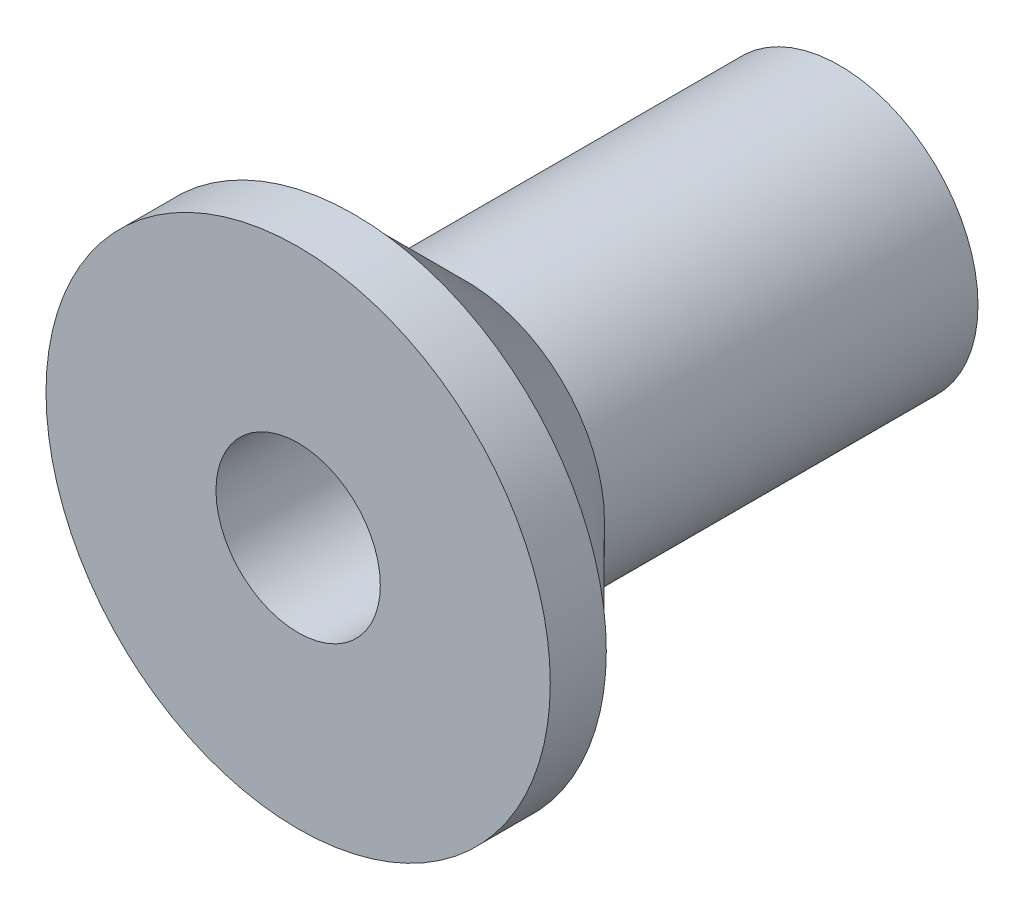
ISO-10303-21;
HEADER;
FILE_DESCRIPTION(('STEP AP214'),'2;1');
FILE_NAME('part.step','',(''),(''),'','','');
FILE_SCHEMA(('AUTOMOTIVE_DESIGN { 1 0 10303 214 1 1 1 1 }'));
ENDSEC;
DATA;
#1=APPLICATION_CONTEXT('core data for automotive mechanical design processes');
#2=APPLICATION_PROTOCOL_DEFINITION('international standard','automotive_design',2000,#1);
#3=PRODUCT_CONTEXT('',#1,'mechanical');
#4=PRODUCT('Part','Part','',(#3));
#5=PRODUCT_RELATED_PRODUCT_CATEGORY('part','',(#4));
#6=PRODUCT_DEFINITION_FORMATION('','',#4);
#7=PRODUCT_DEFINITION_CONTEXT('part definition',#1,'design');
#8=PRODUCT_DEFINITION('design','',#6,#7);
#9=PRODUCT_DEFINITION_SHAPE('','',#8);
#10=(LENGTH_UNIT() NAMED_UNIT(*) SI_UNIT(.MILLI.,.METRE.));
#11=(NAMED_UNIT(*) PLANE_ANGLE_UNIT() SI_UNIT($,.RADIAN.));
#12=(NAMED_UNIT(*) SI_UNIT($,.STERADIAN.) SOLID_ANGLE_UNIT());
#13=UNCERTAINTY_MEASURE_WITH_UNIT(LENGTH_MEASURE(1.E-05),#10,'distance_accuracy_value','');
#14=(GEOMETRIC_REPRESENTATION_CONTEXT(3) GLOBAL_UNCERTAINTY_ASSIGNED_CONTEXT((#13)) GLOBAL_UNIT_ASSIGNED_CONTEXT((#10,
#11,#12)) REPRESENTATION_CONTEXT('',''));
#15=CARTESIAN_POINT('',(0.,0.,0.));
#16=DIRECTION('',(0.,0.,1.));
#17=DIRECTION('',(1.,0.,0.));
#18=AXIS2_PLACEMENT_3D('',#15,#16,#17);
#19=CARTESIAN_POINT('',(0.,0.,-24.5));
#20=DIRECTION('',(0.,0.,-1.));
#21=DIRECTION('',(-1.,0.,0.));
#22=AXIS2_PLACEMENT_3D('',#19,#20,#21);
#23=PLANE('',#22);
#24=CARTESIAN_POINT('',(0.,0.,-24.5));
#25=DIRECTION('',(0.,0.,-1.));
#26=DIRECTION('',(-1.,0.,0.));
#27=AXIS2_PLACEMENT_3D('',#24,#25,#26);
#28=CIRCLE('',#27,6.70000000000001);
#29=CARTESIAN_POINT('',(-6.70000000000001,0.,-24.5));
#30=VERTEX_POINT('',#29);
#31=EDGE_CURVE('E10',#30,#30,#28,.F.);
#32=ORIENTED_EDGE('',*,*,#31,.T.);
#33=EDGE_LOOP('',(#32));
#34=FACE_BOUND('',#33,.T.);
#35=CARTESIAN_POINT('',(0.,0.,-24.5));
#36=DIRECTION('',(0.,0.,-1.));
#37=DIRECTION('',(-1.,0.,0.));
#38=AXIS2_PLACEMENT_3D('',#35,#36,#37);
#39=CIRCLE('',#38,6.75);
#40=CARTESIAN_POINT('',(-6.75,0.,-24.5));
#41=VERTEX_POINT('',#40);
#42=EDGE_CURVE('E44',#41,#41,#39,.T.);
#43=ORIENTED_EDGE('',*,*,#42,.T.);
#44=EDGE_LOOP('',(#43));
#45=FACE_BOUND('',#44,.T.);
#46=ADVANCED_FACE('F32',(#34,#45),#23,.T.);
#47=CARTESIAN_POINT('',(0.,0.,-23.));
#48=DIRECTION('',(0.,0.,-1.));
#49=DIRECTION('',(-1.,0.,0.));
#50=AXIS2_PLACEMENT_3D('',#47,#48,#49);
#51=PLANE('',#50);
#52=CARTESIAN_POINT('',(0.,0.,-23.));
#53=DIRECTION('',(0.,0.,-1.));
#54=DIRECTION('',(-1.,0.,0.));
#55=AXIS2_PLACEMENT_3D('',#52,#53,#54);
#56=CIRCLE('',#55,6.75);
#57=CARTESIAN_POINT('',(-6.75,0.,-23.));
#58=VERTEX_POINT('',#57);
#59=EDGE_CURVE('E48',#58,#58,#56,.T.);
#60=ORIENTED_EDGE('',*,*,#59,.F.);
#61=EDGE_LOOP('',(#60));
#62=FACE_BOUND('',#61,.T.);
#63=CARTESIAN_POINT('',(0.,0.,-23.));
#64=DIRECTION('',(0.,0.,-1.));
#65=DIRECTION('',(-1.,0.,0.));
#66=AXIS2_PLACEMENT_3D('',#63,#64,#65);
#67=CIRCLE('',#66,2.2);
#68=CARTESIAN_POINT('',(-2.2,0.,-23.));
#69=VERTEX_POINT('',#68);
#70=EDGE_CURVE('E52',#69,#69,#67,.T.);
#71=ORIENTED_EDGE('',*,*,#70,.T.);
#72=EDGE_LOOP('',(#71));
#73=FACE_BOUND('',#72,.T.);
#74=ADVANCED_FACE('F78',(#62,#73),#51,.F.);
#75=CARTESIAN_POINT('',(0.,0.,-24.5));
#76=DIRECTION('',(0.,0.,1.));
#77=DIRECTION('',(1.,0.,0.));
#78=AXIS2_PLACEMENT_3D('',#75,#76,#77);
#79=CYLINDRICAL_SURFACE('',#78,6.75);
#80=ORIENTED_EDGE('',*,*,#42,.F.);
#81=EDGE_LOOP('',(#80));
#82=FACE_BOUND('',#81,.T.);
#83=ORIENTED_EDGE('',*,*,#59,.T.);
#84=EDGE_LOOP('',(#83));
#85=FACE_BOUND('',#84,.T.);
#86=ADVANCED_FACE('F69',(#82,#85),#79,.T.);
#87=CARTESIAN_POINT('',(0.,0.,-24.5));
#88=DIRECTION('',(0.,0.,1.));
#89=DIRECTION('',(1.,0.,0.));
#90=AXIS2_PLACEMENT_3D('',#87,#88,#89);
#91=CYLINDRICAL_SURFACE('',#90,2.2);
#92=ORIENTED_EDGE('',*,*,#70,.F.);
#93=EDGE_LOOP('',(#92));
#94=FACE_BOUND('',#93,.T.);
#95=CARTESIAN_POINT('',(0.,0.,-37.5));
#96=DIRECTION('',(0.,0.,1.));
#97=DIRECTION('',(1.,0.,0.));
#98=AXIS2_PLACEMENT_3D('',#95,#96,#97);
#99=CIRCLE('',#98,2.2);
#100=CARTESIAN_POINT('',(2.2,0.,-37.5));
#101=VERTEX_POINT('',#100);
#102=EDGE_CURVE('E59',#101,#101,#99,.T.);
#103=ORIENTED_EDGE('',*,*,#102,.F.);
#104=EDGE_LOOP('',(#103));
#105=FACE_BOUND('',#104,.T.);
#106=ADVANCED_FACE('F66',(#94,#105),#91,.F.);
#107=CARTESIAN_POINT('',(0.,0.,-37.5));
#108=DIRECTION('',(0.,0.,1.));
#109=DIRECTION('',(1.,0.,0.));
#110=AXIS2_PLACEMENT_3D('',#107,#108,#109);
#111=CYLINDRICAL_SURFACE('',#110,3.7);
#112=CARTESIAN_POINT('',(0.,0.,-27.5));
#113=DIRECTION('',(0.,0.,-1.));
#114=DIRECTION('',(-1.,0.,0.));
#115=AXIS2_PLACEMENT_3D('',#112,#113,#114);
#116=CIRCLE('',#115,3.7);
#117=CARTESIAN_POINT('',(-3.7,0.,-27.5));
#118=VERTEX_POINT('',#117);
#119=EDGE_CURVE('E40',#118,#118,#116,.T.);
#120=ORIENTED_EDGE('',*,*,#119,.T.);
#121=EDGE_LOOP('',(#120));
#122=FACE_BOUND('',#121,.T.);
#123=CARTESIAN_POINT('',(0.,0.,-37.5));
#124=DIRECTION('',(0.,0.,1.));
#125=DIRECTION('',(1.,0.,0.));
#126=AXIS2_PLACEMENT_3D('',#123,#124,#125);
#127=CIRCLE('',#126,3.7);
#128=CARTESIAN_POINT('',(3.7,0.,-37.5));
#129=VERTEX_POINT('',#128);
#130=EDGE_CURVE('E56',#129,#129,#127,.T.);
#131=ORIENTED_EDGE('',*,*,#130,.T.);
#132=EDGE_LOOP('',(#131));
#133=FACE_BOUND('',#132,.T.);
#134=ADVANCED_FACE('F68',(#122,#133),#111,.T.);
#135=CARTESIAN_POINT('',(0.,0.,-37.5));
#136=DIRECTION('',(0.,0.,1.));
#137=DIRECTION('',(1.,0.,0.));
#138=AXIS2_PLACEMENT_3D('',#135,#136,#137);
#139=PLANE('',#138);
#140=ORIENTED_EDGE('',*,*,#102,.T.);
#141=EDGE_LOOP('',(#140));
#142=FACE_BOUND('',#141,.T.);
#143=ORIENTED_EDGE('',*,*,#130,.F.);
#144=EDGE_LOOP('',(#143));
#145=FACE_BOUND('',#144,.T.);
#146=ADVANCED_FACE('F63',(#142,#145),#139,.F.);
#147=CARTESIAN_POINT('',(0.,0.,-27.5));
#148=DIRECTION('',(0.,0.,1.));
#149=DIRECTION('',(1.,0.,0.));
#150=AXIS2_PLACEMENT_3D('',#147,#148,#149);
#151=CONICAL_SURFACE('',#150,3.7,0.785398163397443);
#152=ORIENTED_EDGE('',*,*,#31,.F.);
#153=EDGE_LOOP('',(#152));
#154=FACE_BOUND('',#153,.T.);
#155=ORIENTED_EDGE('',*,*,#119,.F.);
#156=EDGE_LOOP('',(#155));
#157=FACE_BOUND('',#156,.T.);
#158=ADVANCED_FACE('F35',(#154,#157),#151,.T.);
#159=CLOSED_SHELL('',(#46,#74,#86,#106,#134,#146,#158));
#160=MANIFOLD_SOLID_BREP('B2',#159);
#161=ADVANCED_BREP_SHAPE_REPRESENTATION('',(#18,#160),#14);
#162=SHAPE_DEFINITION_REPRESENTATION(#9,#161);
ENDSEC;
END-ISO-10303-21;
